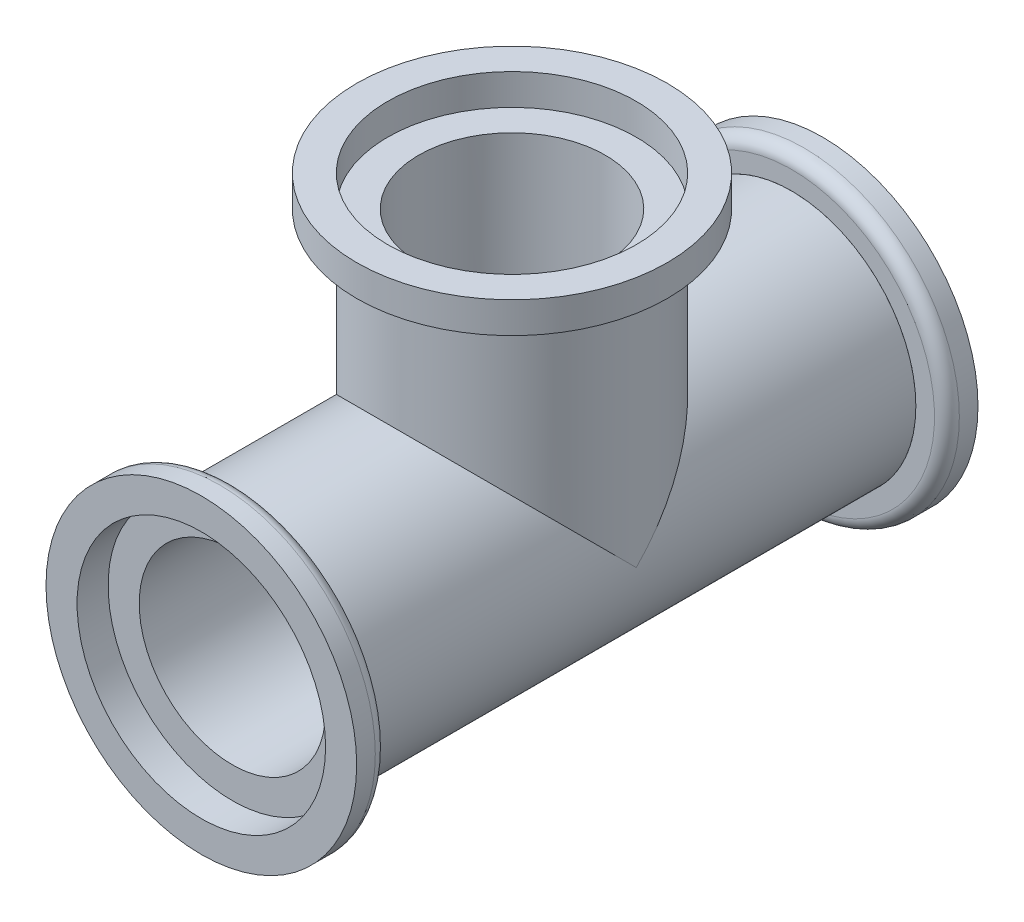
ISO-10303-21;
HEADER;
FILE_DESCRIPTION(('STEP AP214'),'2;1');
FILE_NAME('part.step','',(''),(''),'','','');
FILE_SCHEMA(('AUTOMOTIVE_DESIGN { 1 0 10303 214 1 1 1 1 }'));
ENDSEC;
DATA;
#1=APPLICATION_CONTEXT('core data for automotive mechanical design processes');
#2=APPLICATION_PROTOCOL_DEFINITION('international standard','automotive_design',2000,#1);
#3=PRODUCT_CONTEXT('',#1,'mechanical');
#4=PRODUCT('Part','Part','',(#3));
#5=PRODUCT_RELATED_PRODUCT_CATEGORY('part','',(#4));
#6=PRODUCT_DEFINITION_FORMATION('','',#4);
#7=PRODUCT_DEFINITION_CONTEXT('part definition',#1,'design');
#8=PRODUCT_DEFINITION('design','',#6,#7);
#9=PRODUCT_DEFINITION_SHAPE('','',#8);
#10=(LENGTH_UNIT() NAMED_UNIT(*) SI_UNIT(.MILLI.,.METRE.));
#11=(NAMED_UNIT(*) PLANE_ANGLE_UNIT() SI_UNIT($,.RADIAN.));
#12=(NAMED_UNIT(*) SI_UNIT($,.STERADIAN.) SOLID_ANGLE_UNIT());
#13=UNCERTAINTY_MEASURE_WITH_UNIT(LENGTH_MEASURE(1.E-05),#10,'distance_accuracy_value','');
#14=(GEOMETRIC_REPRESENTATION_CONTEXT(3) GLOBAL_UNCERTAINTY_ASSIGNED_CONTEXT((#13)) GLOBAL_UNIT_ASSIGNED_CONTEXT((#10,
#11,#12)) REPRESENTATION_CONTEXT('',''));
#15=CARTESIAN_POINT('',(0.,0.,0.));
#16=DIRECTION('',(0.,0.,1.));
#17=DIRECTION('',(1.,0.,0.));
#18=AXIS2_PLACEMENT_3D('',#15,#16,#17);
#19=CARTESIAN_POINT('',(0.,22.5,0.));
#20=DIRECTION('',(0.,1.,0.));
#21=DIRECTION('',(0.,0.,1.));
#22=AXIS2_PLACEMENT_3D('',#19,#20,#21);
#23=PLANE('',#22);
#24=CARTESIAN_POINT('',(0.,22.5,0.));
#25=DIRECTION('',(0.,1.,0.));
#26=DIRECTION('',(0.,0.,1.));
#27=AXIS2_PLACEMENT_3D('',#24,#25,#26);
#28=CIRCLE('',#27,12.5);
#29=CARTESIAN_POINT('',(0.,22.5,12.5));
#30=VERTEX_POINT('',#29);
#31=EDGE_CURVE('E12',#30,#30,#28,.T.);
#32=ORIENTED_EDGE('',*,*,#31,.T.);
#33=EDGE_LOOP('',(#32));
#34=FACE_BOUND('',#33,.T.);
#35=CARTESIAN_POINT('',(0.,22.5,0.));
#36=DIRECTION('',(0.,1.,0.));
#37=DIRECTION('',(0.,0.,1.));
#38=AXIS2_PLACEMENT_3D('',#35,#36,#37);
#39=CIRCLE('',#38,10.);
#40=CARTESIAN_POINT('',(0.,22.5,10.));
#41=VERTEX_POINT('',#40);
#42=EDGE_CURVE('E69',#41,#41,#39,.T.);
#43=ORIENTED_EDGE('',*,*,#42,.F.);
#44=EDGE_LOOP('',(#43));
#45=FACE_BOUND('',#44,.T.);
#46=ADVANCED_FACE('F58',(#34,#45),#23,.T.);
#47=CARTESIAN_POINT('',(0.,20.,0.));
#48=DIRECTION('',(0.,1.,0.));
#49=DIRECTION('',(0.,0.,1.));
#50=AXIS2_PLACEMENT_3D('',#47,#48,#49);
#51=PLANE('',#50);
#52=CARTESIAN_POINT('',(0.,20.,0.));
#53=DIRECTION('',(0.,1.,0.));
#54=DIRECTION('',(0.,0.,1.));
#55=AXIS2_PLACEMENT_3D('',#52,#53,#54);
#56=CIRCLE('',#55,12.5);
#57=CARTESIAN_POINT('',(0.,20.,12.5));
#58=VERTEX_POINT('',#57);
#59=EDGE_CURVE('E62',#58,#58,#56,.T.);
#60=ORIENTED_EDGE('',*,*,#59,.F.);
#61=EDGE_LOOP('',(#60));
#62=FACE_BOUND('',#61,.T.);
#63=CARTESIAN_POINT('',(0.,20.,0.));
#64=DIRECTION('',(0.,1.,0.));
#65=DIRECTION('',(0.,0.,1.));
#66=AXIS2_PLACEMENT_3D('',#63,#64,#65);
#67=CIRCLE('',#66,10.);
#68=CARTESIAN_POINT('',(0.,20.,10.));
#69=VERTEX_POINT('',#68);
#70=EDGE_CURVE('E71',#69,#69,#67,.T.);
#71=ORIENTED_EDGE('',*,*,#70,.T.);
#72=EDGE_LOOP('',(#71));
#73=FACE_BOUND('',#72,.T.);
#74=ADVANCED_FACE('F81',(#62,#73),#51,.F.);
#75=CARTESIAN_POINT('',(0.,22.5,0.));
#76=DIRECTION('',(0.,-1.,0.));
#77=DIRECTION('',(0.,0.,-1.));
#78=AXIS2_PLACEMENT_3D('',#75,#76,#77);
#79=CYLINDRICAL_SURFACE('',#78,12.5);
#80=ORIENTED_EDGE('',*,*,#31,.F.);
#81=EDGE_LOOP('',(#80));
#82=FACE_BOUND('',#81,.T.);
#83=ORIENTED_EDGE('',*,*,#59,.T.);
#84=EDGE_LOOP('',(#83));
#85=FACE_BOUND('',#84,.T.);
#86=ADVANCED_FACE('F60',(#82,#85),#79,.T.);
#87=CARTESIAN_POINT('',(0.,22.5,0.));
#88=DIRECTION('',(0.,-1.,0.));
#89=DIRECTION('',(0.,0.,-1.));
#90=AXIS2_PLACEMENT_3D('',#87,#88,#89);
#91=CYLINDRICAL_SURFACE('',#90,10.);
#92=ORIENTED_EDGE('',*,*,#42,.T.);
#93=EDGE_LOOP('',(#92));
#94=FACE_BOUND('',#93,.T.);
#95=ORIENTED_EDGE('',*,*,#70,.F.);
#96=EDGE_LOOP('',(#95));
#97=FACE_BOUND('',#96,.T.);
#98=ADVANCED_FACE('F77',(#94,#97),#91,.F.);
#99=CLOSED_SHELL('',(#46,#74,#86,#98));
#100=MANIFOLD_SOLID_BREP('B2',#99);
#101=CARTESIAN_POINT('',(0.,0.,-25.));
#102=DIRECTION('',(0.,0.,-1.));
#103=DIRECTION('',(-1.,0.,0.));
#104=AXIS2_PLACEMENT_3D('',#101,#102,#103);
#105=PLANE('',#104);
#106=CARTESIAN_POINT('',(0.,0.,-25.));
#107=DIRECTION('',(0.,0.,-1.));
#108=DIRECTION('',(-1.,0.,0.));
#109=AXIS2_PLACEMENT_3D('',#106,#107,#108);
#110=CIRCLE('',#109,12.5);
#111=CARTESIAN_POINT('',(-12.5,0.,-25.));
#112=VERTEX_POINT('',#111);
#113=EDGE_CURVE('E139',#112,#112,#110,.T.);
#114=ORIENTED_EDGE('',*,*,#113,.T.);
#115=EDGE_LOOP('',(#114));
#116=FACE_BOUND('',#115,.T.);
#117=CARTESIAN_POINT('',(0.,0.,-25.));
#118=DIRECTION('',(0.,0.,-1.));
#119=DIRECTION('',(-1.,0.,0.));
#120=AXIS2_PLACEMENT_3D('',#117,#118,#119);
#121=CIRCLE('',#120,10.);
#122=CARTESIAN_POINT('',(-10.,0.,-25.));
#123=VERTEX_POINT('',#122);
#124=EDGE_CURVE('E143',#123,#123,#121,.T.);
#125=ORIENTED_EDGE('',*,*,#124,.F.);
#126=EDGE_LOOP('',(#125));
#127=FACE_BOUND('',#126,.T.);
#128=ADVANCED_FACE('F128',(#116,#127),#105,.T.);
#129=CARTESIAN_POINT('',(0.,0.,-22.5));
#130=DIRECTION('',(0.,0.,-1.));
#131=DIRECTION('',(-1.,0.,0.));
#132=AXIS2_PLACEMENT_3D('',#129,#130,#131);
#133=PLANE('',#132);
#134=CARTESIAN_POINT('',(0.,0.,-22.5));
#135=DIRECTION('',(0.,0.,-1.));
#136=DIRECTION('',(-1.,0.,0.));
#137=AXIS2_PLACEMENT_3D('',#134,#135,#136);
#138=CIRCLE('',#137,11.5);
#139=CARTESIAN_POINT('',(-11.5,0.,-22.5));
#140=VERTEX_POINT('',#139);
#141=EDGE_CURVE('E57',#140,#140,#138,.F.);
#142=ORIENTED_EDGE('',*,*,#141,.T.);
#143=EDGE_LOOP('',(#142));
#144=FACE_BOUND('',#143,.T.);
#145=CARTESIAN_POINT('',(0.,0.,-22.5));
#146=DIRECTION('',(0.,0.,-1.));
#147=DIRECTION('',(-1.,0.,0.));
#148=AXIS2_PLACEMENT_3D('',#145,#146,#147);
#149=CIRCLE('',#148,10.);
#150=CARTESIAN_POINT('',(-10.,0.,-22.5));
#151=VERTEX_POINT('',#150);
#152=EDGE_CURVE('E146',#151,#151,#149,.T.);
#153=ORIENTED_EDGE('',*,*,#152,.T.);
#154=EDGE_LOOP('',(#153));
#155=FACE_BOUND('',#154,.T.);
#156=ADVANCED_FACE('F156',(#144,#155),#133,.F.);
#157=CARTESIAN_POINT('',(0.,0.,-25.));
#158=DIRECTION('',(0.,0.,1.));
#159=DIRECTION('',(1.,0.,0.));
#160=AXIS2_PLACEMENT_3D('',#157,#158,#159);
#161=CYLINDRICAL_SURFACE('',#160,12.5);
#162=CARTESIAN_POINT('',(0.,0.,-23.5));
#163=DIRECTION('',(0.,0.,-1.));
#164=DIRECTION('',(-1.,0.,0.));
#165=AXIS2_PLACEMENT_3D('',#162,#163,#164);
#166=CIRCLE('',#165,12.5);
#167=CARTESIAN_POINT('',(-12.5,0.,-23.5));
#168=VERTEX_POINT('',#167);
#169=EDGE_CURVE('E135',#168,#168,#166,.T.);
#170=ORIENTED_EDGE('',*,*,#169,.T.);
#171=EDGE_LOOP('',(#170));
#172=FACE_BOUND('',#171,.T.);
#173=ORIENTED_EDGE('',*,*,#113,.F.);
#174=EDGE_LOOP('',(#173));
#175=FACE_BOUND('',#174,.T.);
#176=ADVANCED_FACE('F163',(#172,#175),#161,.T.);
#177=CARTESIAN_POINT('',(0.,0.,-25.));
#178=DIRECTION('',(0.,0.,1.));
#179=DIRECTION('',(1.,0.,0.));
#180=AXIS2_PLACEMENT_3D('',#177,#178,#179);
#181=CYLINDRICAL_SURFACE('',#180,10.);
#182=ORIENTED_EDGE('',*,*,#124,.T.);
#183=EDGE_LOOP('',(#182));
#184=FACE_BOUND('',#183,.T.);
#185=ORIENTED_EDGE('',*,*,#152,.F.);
#186=EDGE_LOOP('',(#185));
#187=FACE_BOUND('',#186,.T.);
#188=ADVANCED_FACE('F152',(#184,#187),#181,.F.);
#189=CARTESIAN_POINT('',(0.,0.,-23.5));
#190=DIRECTION('',(0.,0.,-1.));
#191=DIRECTION('',(-1.,0.,0.));
#192=AXIS2_PLACEMENT_3D('',#189,#190,#191);
#193=TOROIDAL_SURFACE('',#192,11.5,1.);
#194=ORIENTED_EDGE('',*,*,#141,.F.);
#195=EDGE_LOOP('',(#194));
#196=FACE_BOUND('',#195,.T.);
#197=ORIENTED_EDGE('',*,*,#169,.F.);
#198=EDGE_LOOP('',(#197));
#199=FACE_BOUND('',#198,.T.);
#200=ADVANCED_FACE('F130',(#196,#199),#193,.T.);
#201=CLOSED_SHELL('',(#128,#156,#176,#188,#200));
#202=MANIFOLD_SOLID_BREP('B7',#201);
#203=CARTESIAN_POINT('',(0.,0.,25.));
#204=DIRECTION('',(0.,0.,1.));
#205=DIRECTION('',(1.,0.,0.));
#206=AXIS2_PLACEMENT_3D('',#203,#204,#205);
#207=PLANE('',#206);
#208=CARTESIAN_POINT('',(0.,0.,25.));
#209=DIRECTION('',(0.,0.,1.));
#210=DIRECTION('',(1.,0.,0.));
#211=AXIS2_PLACEMENT_3D('',#208,#209,#210);
#212=CIRCLE('',#211,12.5);
#213=CARTESIAN_POINT('',(12.5,0.,25.));
#214=VERTEX_POINT('',#213);
#215=EDGE_CURVE('E225',#214,#214,#212,.T.);
#216=ORIENTED_EDGE('',*,*,#215,.T.);
#217=EDGE_LOOP('',(#216));
#218=FACE_BOUND('',#217,.T.);
#219=CARTESIAN_POINT('',(0.,0.,25.));
#220=DIRECTION('',(0.,0.,1.));
#221=DIRECTION('',(1.,0.,0.));
#222=AXIS2_PLACEMENT_3D('',#219,#220,#221);
#223=CIRCLE('',#222,10.);
#224=CARTESIAN_POINT('',(10.,0.,25.));
#225=VERTEX_POINT('',#224);
#226=EDGE_CURVE('E229',#225,#225,#223,.T.);
#227=ORIENTED_EDGE('',*,*,#226,.F.);
#228=EDGE_LOOP('',(#227));
#229=FACE_BOUND('',#228,.T.);
#230=ADVANCED_FACE('F214',(#218,#229),#207,.T.);
#231=CARTESIAN_POINT('',(0.,0.,22.5));
#232=DIRECTION('',(0.,0.,1.));
#233=DIRECTION('',(1.,0.,0.));
#234=AXIS2_PLACEMENT_3D('',#231,#232,#233);
#235=PLANE('',#234);
#236=CARTESIAN_POINT('',(0.,0.,22.5));
#237=DIRECTION('',(0.,0.,1.));
#238=DIRECTION('',(1.,0.,0.));
#239=AXIS2_PLACEMENT_3D('',#236,#237,#238);
#240=CIRCLE('',#239,11.5);
#241=CARTESIAN_POINT('',(11.5,0.,22.5));
#242=VERTEX_POINT('',#241);
#243=EDGE_CURVE('E127',#242,#242,#240,.F.);
#244=ORIENTED_EDGE('',*,*,#243,.T.);
#245=EDGE_LOOP('',(#244));
#246=FACE_BOUND('',#245,.T.);
#247=CARTESIAN_POINT('',(0.,0.,22.5));
#248=DIRECTION('',(0.,0.,1.));
#249=DIRECTION('',(1.,0.,0.));
#250=AXIS2_PLACEMENT_3D('',#247,#248,#249);
#251=CIRCLE('',#250,10.);
#252=CARTESIAN_POINT('',(10.,0.,22.5));
#253=VERTEX_POINT('',#252);
#254=EDGE_CURVE('E232',#253,#253,#251,.T.);
#255=ORIENTED_EDGE('',*,*,#254,.T.);
#256=EDGE_LOOP('',(#255));
#257=FACE_BOUND('',#256,.T.);
#258=ADVANCED_FACE('F242',(#246,#257),#235,.F.);
#259=CARTESIAN_POINT('',(0.,0.,25.));
#260=DIRECTION('',(0.,0.,-1.));
#261=DIRECTION('',(-1.,0.,0.));
#262=AXIS2_PLACEMENT_3D('',#259,#260,#261);
#263=CYLINDRICAL_SURFACE('',#262,12.5);
#264=CARTESIAN_POINT('',(0.,0.,23.5));
#265=DIRECTION('',(0.,0.,1.));
#266=DIRECTION('',(1.,0.,0.));
#267=AXIS2_PLACEMENT_3D('',#264,#265,#266);
#268=CIRCLE('',#267,12.5);
#269=CARTESIAN_POINT('',(12.5,0.,23.5));
#270=VERTEX_POINT('',#269);
#271=EDGE_CURVE('E221',#270,#270,#268,.T.);
#272=ORIENTED_EDGE('',*,*,#271,.T.);
#273=EDGE_LOOP('',(#272));
#274=FACE_BOUND('',#273,.T.);
#275=ORIENTED_EDGE('',*,*,#215,.F.);
#276=EDGE_LOOP('',(#275));
#277=FACE_BOUND('',#276,.T.);
#278=ADVANCED_FACE('F249',(#274,#277),#263,.T.);
#279=CARTESIAN_POINT('',(0.,0.,25.));
#280=DIRECTION('',(0.,0.,-1.));
#281=DIRECTION('',(-1.,0.,0.));
#282=AXIS2_PLACEMENT_3D('',#279,#280,#281);
#283=CYLINDRICAL_SURFACE('',#282,10.);
#284=ORIENTED_EDGE('',*,*,#226,.T.);
#285=EDGE_LOOP('',(#284));
#286=FACE_BOUND('',#285,.T.);
#287=ORIENTED_EDGE('',*,*,#254,.F.);
#288=EDGE_LOOP('',(#287));
#289=FACE_BOUND('',#288,.T.);
#290=ADVANCED_FACE('F238',(#286,#289),#283,.F.);
#291=CARTESIAN_POINT('',(0.,0.,23.5));
#292=DIRECTION('',(0.,0.,1.));
#293=DIRECTION('',(1.,0.,0.));
#294=AXIS2_PLACEMENT_3D('',#291,#292,#293);
#295=TOROIDAL_SURFACE('',#294,11.5,1.);
#296=ORIENTED_EDGE('',*,*,#243,.F.);
#297=EDGE_LOOP('',(#296));
#298=FACE_BOUND('',#297,.T.);
#299=ORIENTED_EDGE('',*,*,#271,.F.);
#300=EDGE_LOOP('',(#299));
#301=FACE_BOUND('',#300,.T.);
#302=ADVANCED_FACE('F216',(#298,#301),#295,.T.);
#303=CLOSED_SHELL('',(#230,#258,#278,#290,#302));
#304=MANIFOLD_SOLID_BREP('B52',#303);
#305=CARTESIAN_POINT('',(0.,0.,-22.5));
#306=DIRECTION('',(0.,0.,1.));
#307=DIRECTION('',(1.,0.,0.));
#308=AXIS2_PLACEMENT_3D('',#305,#306,#307);
#309=CYLINDRICAL_SURFACE('',#308,7.5);
#310=CARTESIAN_POINT('',(0.,0.,22.5));
#311=DIRECTION('',(0.,0.,1.));
#312=DIRECTION('',(1.,0.,0.));
#313=AXIS2_PLACEMENT_3D('',#310,#311,#312);
#314=CIRCLE('',#313,7.5);
#315=CARTESIAN_POINT('',(7.5,0.,22.5));
#316=VERTEX_POINT('',#315);
#317=EDGE_CURVE('E349',#316,#316,#314,.T.);
#318=ORIENTED_EDGE('',*,*,#317,.T.);
#319=EDGE_LOOP('',(#318));
#320=FACE_BOUND('',#319,.T.);
#321=CARTESIAN_POINT('',(0.,0.,-22.5));
#322=DIRECTION('',(0.,0.,1.));
#323=DIRECTION('',(1.,0.,0.));
#324=AXIS2_PLACEMENT_3D('',#321,#322,#323);
#325=CIRCLE('',#324,7.5);
#326=CARTESIAN_POINT('',(7.5,0.,-22.5));
#327=VERTEX_POINT('',#326);
#328=EDGE_CURVE('E366',#327,#327,#325,.T.);
#329=ORIENTED_EDGE('',*,*,#328,.F.);
#330=EDGE_LOOP('',(#329));
#331=FACE_BOUND('',#330,.T.);
#332=DIRECTION('',(0.,0.,1.));
#333=VECTOR('',#332,1.);
#334=CARTESIAN_POINT('',(-7.34846922834953,1.5,-22.5));
#335=LINE('',#334,#333);
#336=CARTESIAN_POINT('',(-7.34846922834953,1.5,1.50000000000001));
#337=VERTEX_POINT('',#336);
#338=CARTESIAN_POINT('',(-7.34846922834953,1.5,-1.50000000000001));
#339=VERTEX_POINT('',#338);
#340=EDGE_CURVE('E212',#337,#339,#335,.F.);
#341=ORIENTED_EDGE('',*,*,#340,.F.);
#342=CARTESIAN_POINT('',(0.,0.,0.));
#343=DIRECTION('',(0.,-0.707106781186548,0.707106781186547));
#344=DIRECTION('',(0.,0.707106781186548,0.707106781186547));
#345=AXIS2_PLACEMENT_3D('',#342,#343,#344);
#346=ELLIPSE('',#345,10.6066017177982,7.5);
#347=CARTESIAN_POINT('',(7.34846922834953,1.5,1.50000000000001));
#348=VERTEX_POINT('',#347);
#349=EDGE_CURVE('E333',#337,#348,#346,.F.);
#350=ORIENTED_EDGE('',*,*,#349,.T.);
#351=DIRECTION('',(0.,0.,1.));
#352=VECTOR('',#351,1.);
#353=CARTESIAN_POINT('',(7.34846922834953,1.5,-22.5));
#354=LINE('',#353,#352);
#355=CARTESIAN_POINT('',(7.34846922834953,1.5,-1.50000000000001));
#356=VERTEX_POINT('',#355);
#357=EDGE_CURVE('E300',#356,#348,#354,.T.);
#358=ORIENTED_EDGE('',*,*,#357,.F.);
#359=CARTESIAN_POINT('',(0.,0.,0.));
#360=DIRECTION('',(0.,0.707106781186548,0.707106781186547));
#361=DIRECTION('',(0.,-0.707106781186548,0.707106781186547));
#362=AXIS2_PLACEMENT_3D('',#359,#360,#361);
#363=ELLIPSE('',#362,10.6066017177982,7.5);
#364=EDGE_CURVE('E335',#356,#339,#363,.T.);
#365=ORIENTED_EDGE('',*,*,#364,.T.);
#366=EDGE_LOOP('',(#341,#350,#358,#365));
#367=FACE_BOUND('',#366,.T.);
#368=ADVANCED_FACE('F291',(#320,#331,#367),#309,.F.);
#369=CARTESIAN_POINT('',(0.,0.,-22.5));
#370=DIRECTION('',(0.,0.,1.));
#371=DIRECTION('',(1.,0.,0.));
#372=AXIS2_PLACEMENT_3D('',#369,#370,#371);
#373=CYLINDRICAL_SURFACE('',#372,10.);
#374=CARTESIAN_POINT('',(0.,0.,0.));
#375=DIRECTION('',(0.,0.707106781186547,0.707106781186547));
#376=DIRECTION('',(0.,0.707106781186547,-0.707106781186547));
#377=AXIS2_PLACEMENT_3D('',#374,#375,#376);
#378=ELLIPSE('',#377,14.1421356237309,10.);
#379=CARTESIAN_POINT('',(-10.,0.,0.));
#380=VERTEX_POINT('',#379);
#381=CARTESIAN_POINT('',(10.,0.,0.));
#382=VERTEX_POINT('',#381);
#383=EDGE_CURVE('E354',#380,#382,#378,.F.);
#384=ORIENTED_EDGE('',*,*,#383,.T.);
#385=CARTESIAN_POINT('',(0.,0.,0.));
#386=DIRECTION('',(0.,0.707106781186547,-0.707106781186547));
#387=DIRECTION('',(0.,0.707106781186547,0.707106781186547));
#388=AXIS2_PLACEMENT_3D('',#385,#386,#387);
#389=ELLIPSE('',#388,14.1421356237309,10.);
#390=EDGE_CURVE('E313',#382,#380,#389,.F.);
#391=ORIENTED_EDGE('',*,*,#390,.T.);
#392=EDGE_LOOP('',(#384,#391));
#393=FACE_BOUND('',#392,.T.);
#394=CARTESIAN_POINT('',(0.,0.,-22.5));
#395=DIRECTION('',(0.,0.,1.));
#396=DIRECTION('',(1.,0.,0.));
#397=AXIS2_PLACEMENT_3D('',#394,#395,#396);
#398=CIRCLE('',#397,10.);
#399=CARTESIAN_POINT('',(10.,0.,-22.5));
#400=VERTEX_POINT('',#399);
#401=EDGE_CURVE('E329',#400,#400,#398,.T.);
#402=ORIENTED_EDGE('',*,*,#401,.T.);
#403=EDGE_LOOP('',(#402));
#404=FACE_BOUND('',#403,.T.);
#405=CARTESIAN_POINT('',(0.,0.,22.5));
#406=DIRECTION('',(0.,0.,1.));
#407=DIRECTION('',(1.,0.,0.));
#408=AXIS2_PLACEMENT_3D('',#405,#406,#407);
#409=CIRCLE('',#408,10.);
#410=CARTESIAN_POINT('',(10.,0.,22.5));
#411=VERTEX_POINT('',#410);
#412=EDGE_CURVE('E362',#411,#411,#409,.T.);
#413=ORIENTED_EDGE('',*,*,#412,.F.);
#414=EDGE_LOOP('',(#413));
#415=FACE_BOUND('',#414,.T.);
#416=ADVANCED_FACE('F293',(#393,#404,#415),#373,.T.);
#417=CARTESIAN_POINT('',(0.,0.,-22.5));
#418=DIRECTION('',(0.,0.,1.));
#419=DIRECTION('',(1.,0.,0.));
#420=AXIS2_PLACEMENT_3D('',#417,#418,#419);
#421=PLANE('',#420);
#422=ORIENTED_EDGE('',*,*,#328,.T.);
#423=EDGE_LOOP('',(#422));
#424=FACE_BOUND('',#423,.T.);
#425=ORIENTED_EDGE('',*,*,#401,.F.);
#426=EDGE_LOOP('',(#425));
#427=FACE_BOUND('',#426,.T.);
#428=ADVANCED_FACE('F376',(#424,#427),#421,.F.);
#429=CARTESIAN_POINT('',(0.,0.,22.5));
#430=DIRECTION('',(0.,0.,1.));
#431=DIRECTION('',(1.,0.,0.));
#432=AXIS2_PLACEMENT_3D('',#429,#430,#431);
#433=PLANE('',#432);
#434=ORIENTED_EDGE('',*,*,#412,.T.);
#435=EDGE_LOOP('',(#434));
#436=FACE_BOUND('',#435,.T.);
#437=ORIENTED_EDGE('',*,*,#317,.F.);
#438=EDGE_LOOP('',(#437));
#439=FACE_BOUND('',#438,.T.);
#440=ADVANCED_FACE('F378',(#436,#439),#433,.T.);
#441=CARTESIAN_POINT('',(0.,20.,0.));
#442=DIRECTION('',(0.,1.,0.));
#443=DIRECTION('',(0.,0.,1.));
#444=AXIS2_PLACEMENT_3D('',#441,#442,#443);
#445=PLANE('',#444);
#446=CARTESIAN_POINT('',(0.,20.,0.));
#447=DIRECTION('',(0.,1.,0.));
#448=DIRECTION('',(0.,0.,1.));
#449=AXIS2_PLACEMENT_3D('',#446,#447,#448);
#450=CIRCLE('',#449,7.5);
#451=CARTESIAN_POINT('',(0.,20.,7.5));
#452=VERTEX_POINT('',#451);
#453=EDGE_CURVE('E350',#452,#452,#450,.T.);
#454=ORIENTED_EDGE('',*,*,#453,.F.);
#455=EDGE_LOOP('',(#454));
#456=FACE_BOUND('',#455,.T.);
#457=CARTESIAN_POINT('',(0.,20.,0.));
#458=DIRECTION('',(0.,1.,0.));
#459=DIRECTION('',(0.,0.,1.));
#460=AXIS2_PLACEMENT_3D('',#457,#458,#459);
#461=CIRCLE('',#460,10.);
#462=CARTESIAN_POINT('',(0.,20.,10.));
#463=VERTEX_POINT('',#462);
#464=EDGE_CURVE('E345',#463,#463,#461,.T.);
#465=ORIENTED_EDGE('',*,*,#464,.T.);
#466=EDGE_LOOP('',(#465));
#467=FACE_BOUND('',#466,.T.);
#468=ADVANCED_FACE('F383',(#456,#467),#445,.T.);
#469=CARTESIAN_POINT('',(0.,-10.002,0.));
#470=DIRECTION('',(0.,1.,0.));
#471=DIRECTION('',(0.,0.,1.));
#472=AXIS2_PLACEMENT_3D('',#469,#470,#471);
#473=CYLINDRICAL_SURFACE('',#472,10.);
#474=ORIENTED_EDGE('',*,*,#383,.F.);
#475=ORIENTED_EDGE('',*,*,#390,.F.);
#476=EDGE_LOOP('',(#474,#475));
#477=FACE_BOUND('',#476,.T.);
#478=ORIENTED_EDGE('',*,*,#464,.F.);
#479=EDGE_LOOP('',(#478));
#480=FACE_BOUND('',#479,.T.);
#481=ADVANCED_FACE('F398',(#477,#480),#473,.T.);
#482=CARTESIAN_POINT('',(0.,-10.002,0.));
#483=DIRECTION('',(0.,1.,0.));
#484=DIRECTION('',(0.,0.,1.));
#485=AXIS2_PLACEMENT_3D('',#482,#483,#484);
#486=CYLINDRICAL_SURFACE('',#485,7.5);
#487=ORIENTED_EDGE('',*,*,#453,.T.);
#488=EDGE_LOOP('',(#487));
#489=FACE_BOUND('',#488,.T.);
#490=CARTESIAN_POINT('',(0.,1.5,0.));
#491=DIRECTION('',(0.,1.,0.));
#492=DIRECTION('',(0.,0.,1.));
#493=AXIS2_PLACEMENT_3D('',#490,#491,#492);
#494=CIRCLE('',#493,7.5);
#495=EDGE_CURVE('E306',#348,#356,#494,.T.);
#496=ORIENTED_EDGE('',*,*,#495,.F.);
#497=ORIENTED_EDGE('',*,*,#349,.F.);
#498=EDGE_CURVE('E337',#339,#337,#494,.T.);
#499=ORIENTED_EDGE('',*,*,#498,.F.);
#500=ORIENTED_EDGE('',*,*,#364,.F.);
#501=EDGE_LOOP('',(#496,#497,#499,#500));
#502=FACE_BOUND('',#501,.T.);
#503=ADVANCED_FACE('F331',(#489,#502),#486,.F.);
#504=CARTESIAN_POINT('',(0.,1.5,0.));
#505=DIRECTION('',(0.,1.,0.));
#506=DIRECTION('',(0.,0.,1.));
#507=AXIS2_PLACEMENT_3D('',#504,#505,#506);
#508=PLANE('',#507);
#509=ORIENTED_EDGE('',*,*,#340,.T.);
#510=ORIENTED_EDGE('',*,*,#498,.T.);
#511=EDGE_LOOP('',(#509,#510));
#512=FACE_BOUND('',#511,.T.);
#513=ADVANCED_FACE('F397',(#512),#508,.T.);
#514=ORIENTED_EDGE('',*,*,#357,.T.);
#515=ORIENTED_EDGE('',*,*,#495,.T.);
#516=EDGE_LOOP('',(#514,#515));
#517=FACE_BOUND('',#516,.T.);
#518=ADVANCED_FACE('F324',(#517),#508,.T.);
#519=CLOSED_SHELL('',(#368,#416,#428,#440,#468,#481,#503,#513,#518));
#520=MANIFOLD_SOLID_BREP('B122',#519);
#521=ADVANCED_BREP_SHAPE_REPRESENTATION('',(#18,#100,#202,#304,#520),#14);
#522=SHAPE_DEFINITION_REPRESENTATION(#9,#521);
ENDSEC;
END-ISO-10303-21;
